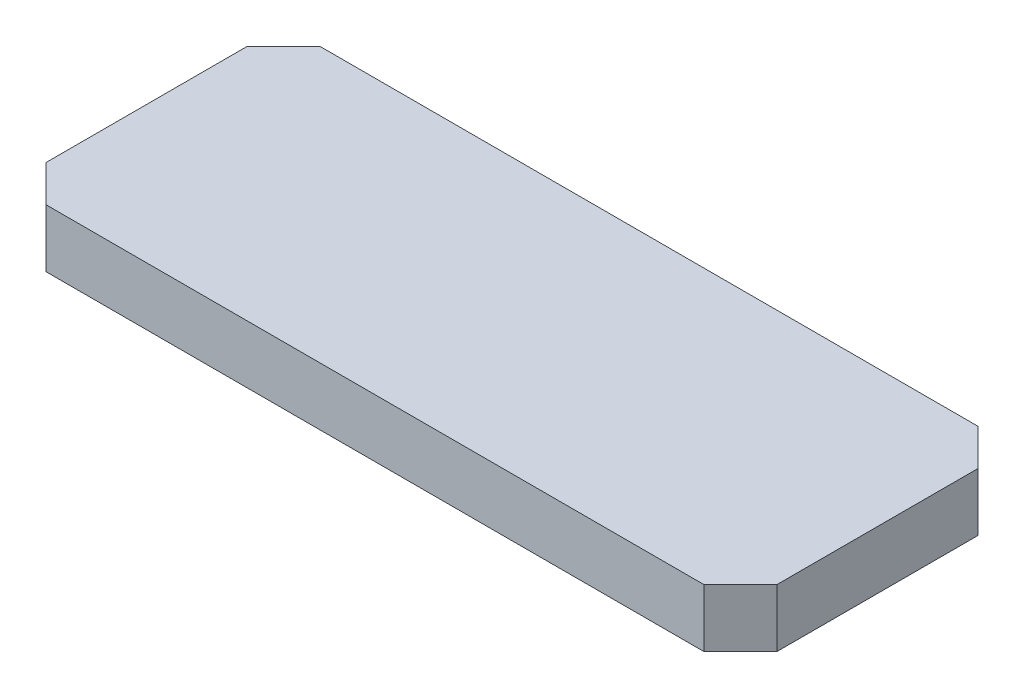
ISO-10303-21;
HEADER;
FILE_DESCRIPTION(('STEP AP214'),'2;1');
FILE_NAME('part.step','',(''),(''),'','','');
FILE_SCHEMA(('AUTOMOTIVE_DESIGN { 1 0 10303 214 1 1 1 1 }'));
ENDSEC;
DATA;
#1=APPLICATION_CONTEXT('core data for automotive mechanical design processes');
#2=APPLICATION_PROTOCOL_DEFINITION('international standard','automotive_design',2000,#1);
#3=PRODUCT_CONTEXT('',#1,'mechanical');
#4=PRODUCT('Part','Part','',(#3));
#5=PRODUCT_RELATED_PRODUCT_CATEGORY('part','',(#4));
#6=PRODUCT_DEFINITION_FORMATION('','',#4);
#7=PRODUCT_DEFINITION_CONTEXT('part definition',#1,'design');
#8=PRODUCT_DEFINITION('design','',#6,#7);
#9=PRODUCT_DEFINITION_SHAPE('','',#8);
#10=(LENGTH_UNIT() NAMED_UNIT(*) SI_UNIT(.MILLI.,.METRE.));
#11=(NAMED_UNIT(*) PLANE_ANGLE_UNIT() SI_UNIT($,.RADIAN.));
#12=(NAMED_UNIT(*) SI_UNIT($,.STERADIAN.) SOLID_ANGLE_UNIT());
#13=UNCERTAINTY_MEASURE_WITH_UNIT(LENGTH_MEASURE(1.E-05),#10,'distance_accuracy_value','');
#14=(GEOMETRIC_REPRESENTATION_CONTEXT(3) GLOBAL_UNCERTAINTY_ASSIGNED_CONTEXT((#13)) GLOBAL_UNIT_ASSIGNED_CONTEXT((#10,
#11,#12)) REPRESENTATION_CONTEXT('',''));
#15=CARTESIAN_POINT('',(0.,0.,0.));
#16=DIRECTION('',(0.,0.,1.));
#17=DIRECTION('',(1.,0.,0.));
#18=AXIS2_PLACEMENT_3D('',#15,#16,#17);
#19=CARTESIAN_POINT('',(0.,0.,0.));
#20=DIRECTION('',(0.,-1.,0.));
#21=DIRECTION('',(1.,0.,0.));
#22=AXIS2_PLACEMENT_3D('',#19,#20,#21);
#23=PLANE('',#22);
#24=DIRECTION('',(1.,0.,0.));
#25=VECTOR('',#24,1.);
#26=CARTESIAN_POINT('',(0.,0.,0.));
#27=LINE('',#26,#25);
#28=CARTESIAN_POINT('',(38.0000000000001,0.,0.));
#29=VERTEX_POINT('',#28);
#30=CARTESIAN_POINT('',(2.,0.,0.));
#31=VERTEX_POINT('',#30);
#32=EDGE_CURVE('E105',#29,#31,#27,.F.);
#33=ORIENTED_EDGE('',*,*,#32,.T.);
#34=DIRECTION('',(-0.707106781186546,0.,-0.707106781186549));
#35=VECTOR('',#34,1.);
#36=CARTESIAN_POINT('',(1.99999999999998,0.,0.));
#37=LINE('',#36,#35);
#38=CARTESIAN_POINT('',(0.,0.,-2.));
#39=VERTEX_POINT('',#38);
#40=EDGE_CURVE('E110',#31,#39,#37,.T.);
#41=ORIENTED_EDGE('',*,*,#40,.T.);
#42=DIRECTION('',(0.,0.,1.));
#43=VECTOR('',#42,1.);
#44=CARTESIAN_POINT('',(0.,0.,0.));
#45=LINE('',#44,#43);
#46=CARTESIAN_POINT('',(0.,0.,-13.));
#47=VERTEX_POINT('',#46);
#48=EDGE_CURVE('E115',#39,#47,#45,.F.);
#49=ORIENTED_EDGE('',*,*,#48,.T.);
#50=DIRECTION('',(0.707106781186548,0.,-0.707106781186547));
#51=VECTOR('',#50,1.);
#52=CARTESIAN_POINT('',(0.,0.,-13.));
#53=LINE('',#52,#51);
#54=CARTESIAN_POINT('',(2.,0.,-15.));
#55=VERTEX_POINT('',#54);
#56=EDGE_CURVE('E120',#47,#55,#53,.T.);
#57=ORIENTED_EDGE('',*,*,#56,.T.);
#58=DIRECTION('',(1.,0.,0.));
#59=VECTOR('',#58,1.);
#60=CARTESIAN_POINT('',(0.,0.,-15.));
#61=LINE('',#60,#59);
#62=CARTESIAN_POINT('',(38.0000000000001,0.,-15.));
#63=VERTEX_POINT('',#62);
#64=EDGE_CURVE('E82',#55,#63,#61,.T.);
#65=ORIENTED_EDGE('',*,*,#64,.T.);
#66=DIRECTION('',(0.707106781186546,0.,0.707106781186549));
#67=VECTOR('',#66,1.);
#68=CARTESIAN_POINT('',(38.0000000000001,0.,-15.));
#69=LINE('',#68,#67);
#70=CARTESIAN_POINT('',(40.0000000000001,0.,-13.));
#71=VERTEX_POINT('',#70);
#72=EDGE_CURVE('E20',#63,#71,#69,.T.);
#73=ORIENTED_EDGE('',*,*,#72,.T.);
#74=DIRECTION('',(0.,0.,1.));
#75=VECTOR('',#74,1.);
#76=CARTESIAN_POINT('',(40.0000000000001,0.,0.));
#77=LINE('',#76,#75);
#78=CARTESIAN_POINT('',(40.0000000000001,0.,-2.));
#79=VERTEX_POINT('',#78);
#80=EDGE_CURVE('E79',#71,#79,#77,.T.);
#81=ORIENTED_EDGE('',*,*,#80,.T.);
#82=DIRECTION('',(-0.707106781186548,0.,0.707106781186547));
#83=VECTOR('',#82,1.);
#84=CARTESIAN_POINT('',(40.0000000000001,0.,-2.));
#85=LINE('',#84,#83);
#86=EDGE_CURVE('E100',#79,#29,#85,.T.);
#87=ORIENTED_EDGE('',*,*,#86,.T.);
#88=EDGE_LOOP('',(#33,#41,#49,#57,#65,#73,#81,#87));
#89=FACE_BOUND('',#88,.T.);
#90=ADVANCED_FACE('F17',(#89),#23,.T.);
#91=CARTESIAN_POINT('',(38.0000000000001,3.17500000000004,-15.));
#92=DIRECTION('',(-0.707106781186549,0.,0.707106781186546));
#93=DIRECTION('',(0.707106781186546,0.,0.707106781186549));
#94=AXIS2_PLACEMENT_3D('',#91,#92,#93);
#95=PLANE('',#94);
#96=DIRECTION('',(0.,-1.,0.));
#97=VECTOR('',#96,1.);
#98=CARTESIAN_POINT('',(40.0000000000001,3.17499999999993,-12.9999999999999));
#99=LINE('',#98,#97);
#100=CARTESIAN_POINT('',(40.0000000000001,3.17499999999999,-13.));
#101=VERTEX_POINT('',#100);
#102=EDGE_CURVE('E87',#101,#71,#99,.T.);
#103=ORIENTED_EDGE('',*,*,#102,.T.);
#104=ORIENTED_EDGE('',*,*,#72,.F.);
#105=DIRECTION('',(0.,-1.,0.));
#106=VECTOR('',#105,1.);
#107=CARTESIAN_POINT('',(38.0000000000001,3.17500000000004,-15.));
#108=LINE('',#107,#106);
#109=CARTESIAN_POINT('',(38.0000000000001,3.17499999999999,-15.));
#110=VERTEX_POINT('',#109);
#111=EDGE_CURVE('E122',#63,#110,#108,.F.);
#112=ORIENTED_EDGE('',*,*,#111,.T.);
#113=DIRECTION('',(0.707106781186526,0.,0.707106781186569));
#114=VECTOR('',#113,1.);
#115=CARTESIAN_POINT('',(38.0000000000001,3.17500000000007,-15.));
#116=LINE('',#115,#114);
#117=EDGE_CURVE('E97',#110,#101,#116,.T.);
#118=ORIENTED_EDGE('',*,*,#117,.T.);
#119=EDGE_LOOP('',(#103,#104,#112,#118));
#120=FACE_BOUND('',#119,.T.);
#121=ADVANCED_FACE('F96',(#120),#95,.F.);
#122=CARTESIAN_POINT('',(40.0000000000001,3.17499999999993,0.));
#123=DIRECTION('',(-1.,0.,0.));
#124=DIRECTION('',(0.,-1.,0.));
#125=AXIS2_PLACEMENT_3D('',#122,#123,#124);
#126=PLANE('',#125);
#127=ORIENTED_EDGE('',*,*,#102,.F.);
#128=DIRECTION('',(0.,0.,1.));
#129=VECTOR('',#128,1.);
#130=CARTESIAN_POINT('',(40.0000000000001,3.17500000000007,0.));
#131=LINE('',#130,#129);
#132=CARTESIAN_POINT('',(40.0000000000001,3.17500000000002,-2.));
#133=VERTEX_POINT('',#132);
#134=EDGE_CURVE('E127',#101,#133,#131,.T.);
#135=ORIENTED_EDGE('',*,*,#134,.T.);
#136=DIRECTION('',(0.,1.,0.));
#137=VECTOR('',#136,1.);
#138=CARTESIAN_POINT('',(40.0000000000001,3.17500000000004,-2.));
#139=LINE('',#138,#137);
#140=EDGE_CURVE('E93',#133,#79,#139,.F.);
#141=ORIENTED_EDGE('',*,*,#140,.T.);
#142=ORIENTED_EDGE('',*,*,#80,.F.);
#143=EDGE_LOOP('',(#127,#135,#141,#142));
#144=FACE_BOUND('',#143,.T.);
#145=ADVANCED_FACE('F90',(#144),#126,.F.);
#146=CARTESIAN_POINT('',(40.0000000000001,3.17500000000004,-2.));
#147=DIRECTION('',(-0.707106781186547,0.,-0.707106781186548));
#148=DIRECTION('',(-0.707106781186548,0.,0.707106781186547));
#149=AXIS2_PLACEMENT_3D('',#146,#147,#148);
#150=PLANE('',#149);
#151=DIRECTION('',(0.,1.,0.));
#152=VECTOR('',#151,1.);
#153=CARTESIAN_POINT('',(38.0000000000001,3.17500000000004,0.));
#154=LINE('',#153,#152);
#155=CARTESIAN_POINT('',(38.0000000000001,3.17499999999999,0.));
#156=VERTEX_POINT('',#155);
#157=EDGE_CURVE('E102',#156,#29,#154,.F.);
#158=ORIENTED_EDGE('',*,*,#157,.T.);
#159=ORIENTED_EDGE('',*,*,#86,.F.);
#160=ORIENTED_EDGE('',*,*,#140,.F.);
#161=DIRECTION('',(-0.707106781186546,0.,0.707106781186549));
#162=VECTOR('',#161,1.);
#163=CARTESIAN_POINT('',(40.0000000000001,3.17500000000007,-2.));
#164=LINE('',#163,#162);
#165=EDGE_CURVE('E129',#133,#156,#164,.T.);
#166=ORIENTED_EDGE('',*,*,#165,.T.);
#167=EDGE_LOOP('',(#158,#159,#160,#166));
#168=FACE_BOUND('',#167,.T.);
#169=ADVANCED_FACE('F162',(#168),#150,.F.);
#170=CARTESIAN_POINT('',(0.,3.17500000000004,0.));
#171=DIRECTION('',(0.,0.,-1.));
#172=DIRECTION('',(0.,1.,0.));
#173=AXIS2_PLACEMENT_3D('',#170,#171,#172);
#174=PLANE('',#173);
#175=ORIENTED_EDGE('',*,*,#157,.F.);
#176=DIRECTION('',(1.,0.,0.));
#177=VECTOR('',#176,1.);
#178=CARTESIAN_POINT('',(0.,3.17500000000004,0.));
#179=LINE('',#178,#177);
#180=CARTESIAN_POINT('',(1.99999999999999,3.17500000000004,0.));
#181=VERTEX_POINT('',#180);
#182=EDGE_CURVE('E132',#156,#181,#179,.F.);
#183=ORIENTED_EDGE('',*,*,#182,.T.);
#184=DIRECTION('',(0.,1.,0.));
#185=VECTOR('',#184,1.);
#186=CARTESIAN_POINT('',(1.99999999999997,3.17500000000004,0.));
#187=LINE('',#186,#185);
#188=EDGE_CURVE('E107',#181,#31,#187,.F.);
#189=ORIENTED_EDGE('',*,*,#188,.T.);
#190=ORIENTED_EDGE('',*,*,#32,.F.);
#191=EDGE_LOOP('',(#175,#183,#189,#190));
#192=FACE_BOUND('',#191,.T.);
#193=ADVANCED_FACE('F159',(#192),#174,.F.);
#194=CARTESIAN_POINT('',(1.99999999999997,3.17500000000004,0.));
#195=DIRECTION('',(0.707106781186549,0.,-0.707106781186546));
#196=DIRECTION('',(-0.707106781186546,0.,-0.707106781186549));
#197=AXIS2_PLACEMENT_3D('',#194,#195,#196);
#198=PLANE('',#197);
#199=DIRECTION('',(0.,1.,0.));
#200=VECTOR('',#199,1.);
#201=CARTESIAN_POINT('',(0.,3.17500000000004,-2.));
#202=LINE('',#201,#200);
#203=CARTESIAN_POINT('',(0.,3.17500000000004,-2.));
#204=VERTEX_POINT('',#203);
#205=EDGE_CURVE('E112',#204,#39,#202,.F.);
#206=ORIENTED_EDGE('',*,*,#205,.T.);
#207=ORIENTED_EDGE('',*,*,#40,.F.);
#208=ORIENTED_EDGE('',*,*,#188,.F.);
#209=DIRECTION('',(-0.707106781186547,0.,-0.707106781186547));
#210=VECTOR('',#209,1.);
#211=CARTESIAN_POINT('',(1.99999999999997,3.17500000000004,0.));
#212=LINE('',#211,#210);
#213=EDGE_CURVE('E135',#181,#204,#212,.T.);
#214=ORIENTED_EDGE('',*,*,#213,.T.);
#215=EDGE_LOOP('',(#206,#207,#208,#214));
#216=FACE_BOUND('',#215,.T.);
#217=ADVANCED_FACE('F155',(#216),#198,.F.);
#218=CARTESIAN_POINT('',(0.,3.17500000000004,0.));
#219=DIRECTION('',(1.,0.,0.));
#220=DIRECTION('',(0.,1.,0.));
#221=AXIS2_PLACEMENT_3D('',#218,#219,#220);
#222=PLANE('',#221);
#223=DIRECTION('',(0.,1.,0.));
#224=VECTOR('',#223,1.);
#225=CARTESIAN_POINT('',(0.,3.17500000000004,-13.));
#226=LINE('',#225,#224);
#227=CARTESIAN_POINT('',(0.,3.17500000000004,-13.));
#228=VERTEX_POINT('',#227);
#229=EDGE_CURVE('E117',#228,#47,#226,.F.);
#230=ORIENTED_EDGE('',*,*,#229,.T.);
#231=ORIENTED_EDGE('',*,*,#48,.F.);
#232=ORIENTED_EDGE('',*,*,#205,.F.);
#233=DIRECTION('',(0.,0.,1.));
#234=VECTOR('',#233,1.);
#235=CARTESIAN_POINT('',(0.,3.17500000000004,0.));
#236=LINE('',#235,#234);
#237=EDGE_CURVE('E138',#204,#228,#236,.F.);
#238=ORIENTED_EDGE('',*,*,#237,.T.);
#239=EDGE_LOOP('',(#230,#231,#232,#238));
#240=FACE_BOUND('',#239,.T.);
#241=ADVANCED_FACE('F151',(#240),#222,.F.);
#242=CARTESIAN_POINT('',(0.,3.17500000000004,-13.));
#243=DIRECTION('',(0.707106781186547,0.,0.707106781186548));
#244=DIRECTION('',(0.707106781186548,0.,-0.707106781186547));
#245=AXIS2_PLACEMENT_3D('',#242,#243,#244);
#246=PLANE('',#245);
#247=DIRECTION('',(0.,-1.,0.));
#248=VECTOR('',#247,1.);
#249=CARTESIAN_POINT('',(2.,3.17500000000004,-15.));
#250=LINE('',#249,#248);
#251=CARTESIAN_POINT('',(2.,3.17500000000004,-15.));
#252=VERTEX_POINT('',#251);
#253=EDGE_CURVE('E34',#252,#55,#250,.T.);
#254=ORIENTED_EDGE('',*,*,#253,.T.);
#255=ORIENTED_EDGE('',*,*,#56,.F.);
#256=ORIENTED_EDGE('',*,*,#229,.F.);
#257=DIRECTION('',(0.707106781186547,0.,-0.707106781186548));
#258=VECTOR('',#257,1.);
#259=CARTESIAN_POINT('',(0.,3.17500000000003,-13.));
#260=LINE('',#259,#258);
#261=EDGE_CURVE('E26',#228,#252,#260,.T.);
#262=ORIENTED_EDGE('',*,*,#261,.T.);
#263=EDGE_LOOP('',(#254,#255,#256,#262));
#264=FACE_BOUND('',#263,.T.);
#265=ADVANCED_FACE('F144',(#264),#246,.F.);
#266=CARTESIAN_POINT('',(0.,3.17500000000004,-15.));
#267=DIRECTION('',(0.,0.,1.));
#268=DIRECTION('',(0.,-1.,0.));
#269=AXIS2_PLACEMENT_3D('',#266,#267,#268);
#270=PLANE('',#269);
#271=ORIENTED_EDGE('',*,*,#253,.F.);
#272=DIRECTION('',(1.,0.,0.));
#273=VECTOR('',#272,1.);
#274=CARTESIAN_POINT('',(0.,3.17500000000003,-15.));
#275=LINE('',#274,#273);
#276=EDGE_CURVE('E11',#252,#110,#275,.T.);
#277=ORIENTED_EDGE('',*,*,#276,.T.);
#278=ORIENTED_EDGE('',*,*,#111,.F.);
#279=ORIENTED_EDGE('',*,*,#64,.F.);
#280=EDGE_LOOP('',(#271,#277,#278,#279));
#281=FACE_BOUND('',#280,.T.);
#282=ADVANCED_FACE('F163',(#281),#270,.F.);
#283=CARTESIAN_POINT('',(0.,3.17500000000004,0.));
#284=DIRECTION('',(0.,-1.,0.));
#285=DIRECTION('',(1.,0.,0.));
#286=AXIS2_PLACEMENT_3D('',#283,#284,#285);
#287=PLANE('',#286);
#288=ORIENTED_EDGE('',*,*,#261,.F.);
#289=ORIENTED_EDGE('',*,*,#237,.F.);
#290=ORIENTED_EDGE('',*,*,#213,.F.);
#291=ORIENTED_EDGE('',*,*,#182,.F.);
#292=ORIENTED_EDGE('',*,*,#165,.F.);
#293=ORIENTED_EDGE('',*,*,#134,.F.);
#294=ORIENTED_EDGE('',*,*,#117,.F.);
#295=ORIENTED_EDGE('',*,*,#276,.F.);
#296=EDGE_LOOP('',(#288,#289,#290,#291,#292,#293,#294,#295));
#297=FACE_BOUND('',#296,.T.);
#298=ADVANCED_FACE('F148',(#297),#287,.F.);
#299=CLOSED_SHELL('',(#90,#121,#145,#169,#193,#217,#241,#265,#282,#298));
#300=MANIFOLD_SOLID_BREP('B1',#299);
#301=ADVANCED_BREP_SHAPE_REPRESENTATION('',(#18,#300),#14);
#302=SHAPE_DEFINITION_REPRESENTATION(#9,#301);
ENDSEC;
END-ISO-10303-21;
